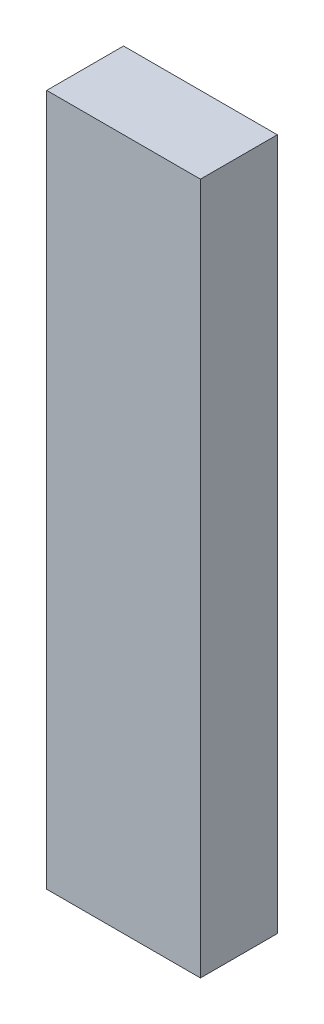
ISO-10303-21;
HEADER;
FILE_DESCRIPTION(('STEP AP214'),'2;1');
FILE_NAME('part.step','',(''),(''),'','','');
FILE_SCHEMA(('AUTOMOTIVE_DESIGN { 1 0 10303 214 1 1 1 1 }'));
ENDSEC;
DATA;
#1=APPLICATION_CONTEXT('core data for automotive mechanical design processes');
#2=APPLICATION_PROTOCOL_DEFINITION('international standard','automotive_design',2000,#1);
#3=PRODUCT_CONTEXT('',#1,'mechanical');
#4=PRODUCT('Part','Part','',(#3));
#5=PRODUCT_RELATED_PRODUCT_CATEGORY('part','',(#4));
#6=PRODUCT_DEFINITION_FORMATION('','',#4);
#7=PRODUCT_DEFINITION_CONTEXT('part definition',#1,'design');
#8=PRODUCT_DEFINITION('design','',#6,#7);
#9=PRODUCT_DEFINITION_SHAPE('','',#8);
#10=(LENGTH_UNIT() NAMED_UNIT(*) SI_UNIT(.MILLI.,.METRE.));
#11=(NAMED_UNIT(*) PLANE_ANGLE_UNIT() SI_UNIT($,.RADIAN.));
#12=(NAMED_UNIT(*) SI_UNIT($,.STERADIAN.) SOLID_ANGLE_UNIT());
#13=UNCERTAINTY_MEASURE_WITH_UNIT(LENGTH_MEASURE(1.E-05),#10,'distance_accuracy_value','');
#14=(GEOMETRIC_REPRESENTATION_CONTEXT(3) GLOBAL_UNCERTAINTY_ASSIGNED_CONTEXT((#13)) GLOBAL_UNIT_ASSIGNED_CONTEXT((#10,
#11,#12)) REPRESENTATION_CONTEXT('',''));
#15=CARTESIAN_POINT('',(0.,0.,0.));
#16=DIRECTION('',(0.,0.,1.));
#17=DIRECTION('',(1.,0.,0.));
#18=AXIS2_PLACEMENT_3D('',#15,#16,#17);
#19=CARTESIAN_POINT('',(0.,45.,5.));
#20=DIRECTION('',(1.,0.,0.));
#21=DIRECTION('',(0.,1.,0.));
#22=AXIS2_PLACEMENT_3D('',#19,#20,#21);
#23=PLANE('',#22);
#24=DIRECTION('',(0.,-1.,0.));
#25=VECTOR('',#24,1.);
#26=CARTESIAN_POINT('',(0.,45.,0.));
#27=LINE('',#26,#25);
#28=CARTESIAN_POINT('',(0.,45.,0.));
#29=VERTEX_POINT('',#28);
#30=CARTESIAN_POINT('',(0.,0.,0.));
#31=VERTEX_POINT('',#30);
#32=EDGE_CURVE('E94',#29,#31,#27,.T.);
#33=ORIENTED_EDGE('',*,*,#32,.T.);
#34=DIRECTION('',(0.,0.,-1.));
#35=VECTOR('',#34,1.);
#36=CARTESIAN_POINT('',(0.,0.,5.));
#37=LINE('',#36,#35);
#38=CARTESIAN_POINT('',(0.,0.,5.));
#39=VERTEX_POINT('',#38);
#40=EDGE_CURVE('E11',#39,#31,#37,.T.);
#41=ORIENTED_EDGE('',*,*,#40,.F.);
#42=DIRECTION('',(0.,-1.,0.));
#43=VECTOR('',#42,1.);
#44=CARTESIAN_POINT('',(0.,45.,5.));
#45=LINE('',#44,#43);
#46=CARTESIAN_POINT('',(0.,45.,5.));
#47=VERTEX_POINT('',#46);
#48=EDGE_CURVE('E82',#47,#39,#45,.T.);
#49=ORIENTED_EDGE('',*,*,#48,.F.);
#50=DIRECTION('',(0.,0.,-1.));
#51=VECTOR('',#50,1.);
#52=CARTESIAN_POINT('',(0.,45.,5.));
#53=LINE('',#52,#51);
#54=EDGE_CURVE('E90',#47,#29,#53,.T.);
#55=ORIENTED_EDGE('',*,*,#54,.T.);
#56=EDGE_LOOP('',(#33,#41,#49,#55));
#57=FACE_BOUND('',#56,.T.);
#58=ADVANCED_FACE('F31',(#57),#23,.F.);
#59=CARTESIAN_POINT('',(0.,0.,5.));
#60=DIRECTION('',(0.,1.,0.));
#61=DIRECTION('',(0.,0.,1.));
#62=AXIS2_PLACEMENT_3D('',#59,#60,#61);
#63=PLANE('',#62);
#64=DIRECTION('',(1.,0.,0.));
#65=VECTOR('',#64,1.);
#66=CARTESIAN_POINT('',(0.,0.,0.));
#67=LINE('',#66,#65);
#68=CARTESIAN_POINT('',(10.,0.,0.));
#69=VERTEX_POINT('',#68);
#70=EDGE_CURVE('E86',#31,#69,#67,.T.);
#71=ORIENTED_EDGE('',*,*,#70,.T.);
#72=DIRECTION('',(0.,0.,-1.));
#73=VECTOR('',#72,1.);
#74=CARTESIAN_POINT('',(10.,0.,5.));
#75=LINE('',#74,#73);
#76=CARTESIAN_POINT('',(10.,0.,5.));
#77=VERTEX_POINT('',#76);
#78=EDGE_CURVE('E39',#77,#69,#75,.T.);
#79=ORIENTED_EDGE('',*,*,#78,.F.);
#80=DIRECTION('',(1.,0.,0.));
#81=VECTOR('',#80,1.);
#82=CARTESIAN_POINT('',(0.,0.,5.));
#83=LINE('',#82,#81);
#84=EDGE_CURVE('E77',#39,#77,#83,.T.);
#85=ORIENTED_EDGE('',*,*,#84,.F.);
#86=ORIENTED_EDGE('',*,*,#40,.T.);
#87=EDGE_LOOP('',(#71,#79,#85,#86));
#88=FACE_BOUND('',#87,.T.);
#89=ADVANCED_FACE('F85',(#88),#63,.F.);
#90=CARTESIAN_POINT('',(10.,0.,5.));
#91=DIRECTION('',(-1.,0.,0.));
#92=DIRECTION('',(0.,0.,1.));
#93=AXIS2_PLACEMENT_3D('',#90,#91,#92);
#94=PLANE('',#93);
#95=DIRECTION('',(0.,1.,0.));
#96=VECTOR('',#95,1.);
#97=CARTESIAN_POINT('',(10.,0.,0.));
#98=LINE('',#97,#96);
#99=CARTESIAN_POINT('',(10.,45.,0.));
#100=VERTEX_POINT('',#99);
#101=EDGE_CURVE('E64',#69,#100,#98,.T.);
#102=ORIENTED_EDGE('',*,*,#101,.T.);
#103=DIRECTION('',(0.,0.,-1.));
#104=VECTOR('',#103,1.);
#105=CARTESIAN_POINT('',(10.,45.,5.));
#106=LINE('',#105,#104);
#107=CARTESIAN_POINT('',(10.,45.,5.));
#108=VERTEX_POINT('',#107);
#109=EDGE_CURVE('E87',#108,#100,#106,.T.);
#110=ORIENTED_EDGE('',*,*,#109,.F.);
#111=DIRECTION('',(0.,1.,0.));
#112=VECTOR('',#111,1.);
#113=CARTESIAN_POINT('',(10.,0.,5.));
#114=LINE('',#113,#112);
#115=EDGE_CURVE('E80',#77,#108,#114,.T.);
#116=ORIENTED_EDGE('',*,*,#115,.F.);
#117=ORIENTED_EDGE('',*,*,#78,.T.);
#118=EDGE_LOOP('',(#102,#110,#116,#117));
#119=FACE_BOUND('',#118,.T.);
#120=ADVANCED_FACE('F88',(#119),#94,.F.);
#121=CARTESIAN_POINT('',(10.,45.,5.));
#122=DIRECTION('',(0.,-1.,0.));
#123=DIRECTION('',(0.,0.,-1.));
#124=AXIS2_PLACEMENT_3D('',#121,#122,#123);
#125=PLANE('',#124);
#126=DIRECTION('',(-1.,0.,0.));
#127=VECTOR('',#126,1.);
#128=CARTESIAN_POINT('',(10.,45.,0.));
#129=LINE('',#128,#127);
#130=EDGE_CURVE('E70',#100,#29,#129,.T.);
#131=ORIENTED_EDGE('',*,*,#130,.T.);
#132=ORIENTED_EDGE('',*,*,#54,.F.);
#133=DIRECTION('',(-1.,0.,0.));
#134=VECTOR('',#133,1.);
#135=CARTESIAN_POINT('',(10.,45.,5.));
#136=LINE('',#135,#134);
#137=EDGE_CURVE('E47',#108,#47,#136,.T.);
#138=ORIENTED_EDGE('',*,*,#137,.F.);
#139=ORIENTED_EDGE('',*,*,#109,.T.);
#140=EDGE_LOOP('',(#131,#132,#138,#139));
#141=FACE_BOUND('',#140,.T.);
#142=ADVANCED_FACE('F101',(#141),#125,.F.);
#143=CARTESIAN_POINT('',(0.,0.,5.));
#144=DIRECTION('',(0.,0.,1.));
#145=DIRECTION('',(1.,0.,0.));
#146=AXIS2_PLACEMENT_3D('',#143,#144,#145);
#147=PLANE('',#146);
#148=ORIENTED_EDGE('',*,*,#48,.T.);
#149=ORIENTED_EDGE('',*,*,#84,.T.);
#150=ORIENTED_EDGE('',*,*,#115,.T.);
#151=ORIENTED_EDGE('',*,*,#137,.T.);
#152=EDGE_LOOP('',(#148,#149,#150,#151));
#153=FACE_BOUND('',#152,.T.);
#154=ADVANCED_FACE('F78',(#153),#147,.T.);
#155=CARTESIAN_POINT('',(0.,0.,0.));
#156=DIRECTION('',(0.,0.,1.));
#157=DIRECTION('',(1.,0.,0.));
#158=AXIS2_PLACEMENT_3D('',#155,#156,#157);
#159=PLANE('',#158);
#160=ORIENTED_EDGE('',*,*,#32,.F.);
#161=ORIENTED_EDGE('',*,*,#130,.F.);
#162=ORIENTED_EDGE('',*,*,#101,.F.);
#163=ORIENTED_EDGE('',*,*,#70,.F.);
#164=EDGE_LOOP('',(#160,#161,#162,#163));
#165=FACE_BOUND('',#164,.T.);
#166=ADVANCED_FACE('F104',(#165),#159,.F.);
#167=CLOSED_SHELL('',(#58,#89,#120,#142,#154,#166));
#168=MANIFOLD_SOLID_BREP('B2',#167);
#169=ADVANCED_BREP_SHAPE_REPRESENTATION('',(#18,#168),#14);
#170=SHAPE_DEFINITION_REPRESENTATION(#9,#169);
ENDSEC;
END-ISO-10303-21;
